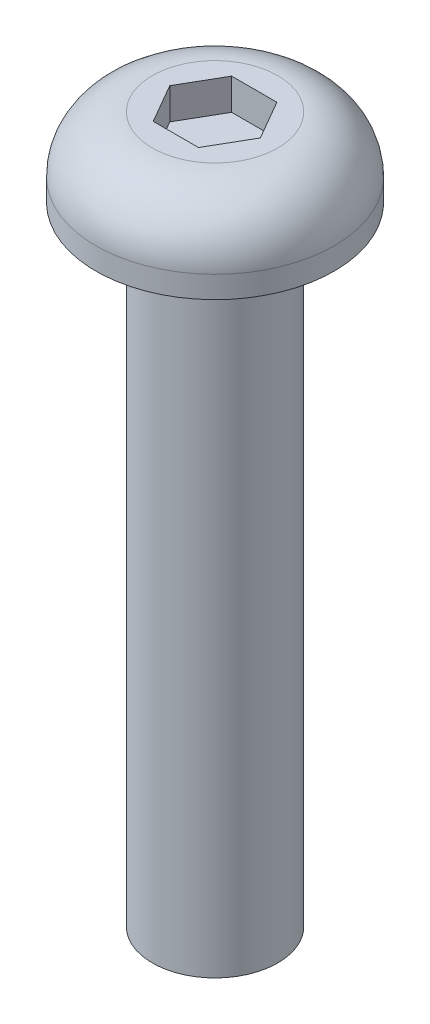
ISO-10303-21;
HEADER;
FILE_DESCRIPTION(('STEP AP214'),'2;1');
FILE_NAME('part.step','',(''),(''),'','','');
FILE_SCHEMA(('AUTOMOTIVE_DESIGN { 1 0 10303 214 1 1 1 1 }'));
ENDSEC;
DATA;
#1=APPLICATION_CONTEXT('core data for automotive mechanical design processes');
#2=APPLICATION_PROTOCOL_DEFINITION('international standard','automotive_design',2000,#1);
#3=PRODUCT_CONTEXT('',#1,'mechanical');
#4=PRODUCT('Part','Part','',(#3));
#5=PRODUCT_RELATED_PRODUCT_CATEGORY('part','',(#4));
#6=PRODUCT_DEFINITION_FORMATION('','',#4);
#7=PRODUCT_DEFINITION_CONTEXT('part definition',#1,'design');
#8=PRODUCT_DEFINITION('design','',#6,#7);
#9=PRODUCT_DEFINITION_SHAPE('','',#8);
#10=(LENGTH_UNIT() NAMED_UNIT(*) SI_UNIT(.MILLI.,.METRE.));
#11=(NAMED_UNIT(*) PLANE_ANGLE_UNIT() SI_UNIT($,.RADIAN.));
#12=(NAMED_UNIT(*) SI_UNIT($,.STERADIAN.) SOLID_ANGLE_UNIT());
#13=UNCERTAINTY_MEASURE_WITH_UNIT(LENGTH_MEASURE(1.E-05),#10,'distance_accuracy_value','');
#14=(GEOMETRIC_REPRESENTATION_CONTEXT(3) GLOBAL_UNCERTAINTY_ASSIGNED_CONTEXT((#13)) GLOBAL_UNIT_ASSIGNED_CONTEXT((#10,
#11,#12)) REPRESENTATION_CONTEXT('',''));
#15=CARTESIAN_POINT('',(0.,0.,0.));
#16=DIRECTION('',(0.,0.,1.));
#17=DIRECTION('',(1.,0.,0.));
#18=AXIS2_PLACEMENT_3D('',#15,#16,#17);
#19=CARTESIAN_POINT('',(0.,-20.,0.));
#20=DIRECTION('',(0.,-1.,0.));
#21=DIRECTION('',(0.,0.,-1.));
#22=AXIS2_PLACEMENT_3D('',#19,#20,#21);
#23=CYLINDRICAL_SURFACE('',#22,2.);
#24=CARTESIAN_POINT('',(0.,0.,0.));
#25=DIRECTION('',(0.,-1.,0.));
#26=DIRECTION('',(0.,0.,-1.));
#27=AXIS2_PLACEMENT_3D('',#24,#25,#26);
#28=CIRCLE('',#27,2.);
#29=CARTESIAN_POINT('',(0.,0.,-2.));
#30=VERTEX_POINT('',#29);
#31=EDGE_CURVE('E11',#30,#30,#28,.T.);
#32=ORIENTED_EDGE('',*,*,#31,.T.);
#33=EDGE_LOOP('',(#32));
#34=FACE_BOUND('',#33,.T.);
#35=CARTESIAN_POINT('',(0.,-20.,0.));
#36=DIRECTION('',(0.,-1.,0.));
#37=DIRECTION('',(0.,0.,-1.));
#38=AXIS2_PLACEMENT_3D('',#35,#36,#37);
#39=CIRCLE('',#38,2.);
#40=CARTESIAN_POINT('',(0.,-20.,-2.));
#41=VERTEX_POINT('',#40);
#42=EDGE_CURVE('E147',#41,#41,#39,.T.);
#43=ORIENTED_EDGE('',*,*,#42,.F.);
#44=EDGE_LOOP('',(#43));
#45=FACE_BOUND('',#44,.T.);
#46=ADVANCED_FACE('F42',(#34,#45),#23,.T.);
#47=CARTESIAN_POINT('',(2.,0.,0.));
#48=DIRECTION('',(0.,-1.,0.));
#49=DIRECTION('',(0.,0.,-1.));
#50=AXIS2_PLACEMENT_3D('',#47,#48,#49);
#51=PLANE('',#50);
#52=CARTESIAN_POINT('',(0.,0.,0.));
#53=DIRECTION('',(0.,-1.,0.));
#54=DIRECTION('',(0.,0.,-1.));
#55=AXIS2_PLACEMENT_3D('',#52,#53,#54);
#56=CIRCLE('',#55,3.8);
#57=CARTESIAN_POINT('',(0.,0.,-3.8));
#58=VERTEX_POINT('',#57);
#59=EDGE_CURVE('E50',#58,#58,#56,.T.);
#60=ORIENTED_EDGE('',*,*,#59,.T.);
#61=EDGE_LOOP('',(#60));
#62=FACE_BOUND('',#61,.T.);
#63=ORIENTED_EDGE('',*,*,#31,.F.);
#64=EDGE_LOOP('',(#63));
#65=FACE_BOUND('',#64,.T.);
#66=ADVANCED_FACE('F167',(#62,#65),#51,.T.);
#67=CARTESIAN_POINT('',(0.,-20.,0.));
#68=DIRECTION('',(0.,-1.,0.));
#69=DIRECTION('',(0.,0.,-1.));
#70=AXIS2_PLACEMENT_3D('',#67,#68,#69);
#71=CYLINDRICAL_SURFACE('',#70,3.8);
#72=CARTESIAN_POINT('',(0.,0.699999999999999,0.));
#73=DIRECTION('',(0.,-1.,0.));
#74=DIRECTION('',(0.,0.,-1.));
#75=AXIS2_PLACEMENT_3D('',#72,#73,#74);
#76=CIRCLE('',#75,3.8);
#77=CARTESIAN_POINT('',(0.,0.699999999999999,-3.8));
#78=VERTEX_POINT('',#77);
#79=EDGE_CURVE('E160',#78,#78,#76,.T.);
#80=ORIENTED_EDGE('',*,*,#79,.T.);
#81=EDGE_LOOP('',(#80));
#82=FACE_BOUND('',#81,.T.);
#83=ORIENTED_EDGE('',*,*,#59,.F.);
#84=EDGE_LOOP('',(#83));
#85=FACE_BOUND('',#84,.T.);
#86=ADVANCED_FACE('F170',(#82,#85),#71,.T.);
#87=CARTESIAN_POINT('',(0.,0.7,0.));
#88=DIRECTION('',(0.,-1.,0.));
#89=DIRECTION('',(0.,0.,-1.));
#90=AXIS2_PLACEMENT_3D('',#87,#88,#89);
#91=TOROIDAL_SURFACE('',#90,2.,1.8);
#92=CARTESIAN_POINT('',(0.,2.5,0.));
#93=DIRECTION('',(0.,-1.,0.));
#94=DIRECTION('',(0.,0.,-1.));
#95=AXIS2_PLACEMENT_3D('',#92,#93,#94);
#96=CIRCLE('',#95,2.);
#97=CARTESIAN_POINT('',(0.,2.5,-2.));
#98=VERTEX_POINT('',#97);
#99=EDGE_CURVE('E156',#98,#98,#96,.T.);
#100=ORIENTED_EDGE('',*,*,#99,.T.);
#101=EDGE_LOOP('',(#100));
#102=FACE_BOUND('',#101,.T.);
#103=ORIENTED_EDGE('',*,*,#79,.F.);
#104=EDGE_LOOP('',(#103));
#105=FACE_BOUND('',#104,.T.);
#106=ADVANCED_FACE('F172',(#102,#105),#91,.T.);
#107=CARTESIAN_POINT('',(2.,2.5,0.));
#108=DIRECTION('',(0.,1.,0.));
#109=DIRECTION('',(0.,0.,1.));
#110=AXIS2_PLACEMENT_3D('',#107,#108,#109);
#111=PLANE('',#110);
#112=DIRECTION('',(-0.5,0.,-0.866025403784438));
#113=VECTOR('',#112,1.);
#114=CARTESIAN_POINT('',(1.44337567297406,2.5,0.));
#115=LINE('',#114,#113);
#116=CARTESIAN_POINT('',(1.44337567297406,2.5,0.));
#117=VERTEX_POINT('',#116);
#118=CARTESIAN_POINT('',(0.721687836487031,2.5,-1.25));
#119=VERTEX_POINT('',#118);
#120=EDGE_CURVE('E57',#117,#119,#115,.T.);
#121=ORIENTED_EDGE('',*,*,#120,.F.);
#122=DIRECTION('',(0.5,0.,-0.866025403784439));
#123=VECTOR('',#122,1.);
#124=CARTESIAN_POINT('',(0.721687836487032,2.5,1.25));
#125=LINE('',#124,#123);
#126=CARTESIAN_POINT('',(0.721687836487032,2.5,1.25));
#127=VERTEX_POINT('',#126);
#128=EDGE_CURVE('E143',#127,#117,#125,.T.);
#129=ORIENTED_EDGE('',*,*,#128,.F.);
#130=DIRECTION('',(1.,0.,0.));
#131=VECTOR('',#130,1.);
#132=CARTESIAN_POINT('',(-0.721687836487032,2.5,1.25));
#133=LINE('',#132,#131);
#134=CARTESIAN_POINT('',(-0.721687836487032,2.5,1.25));
#135=VERTEX_POINT('',#134);
#136=EDGE_CURVE('E141',#135,#127,#133,.T.);
#137=ORIENTED_EDGE('',*,*,#136,.F.);
#138=DIRECTION('',(0.5,0.,0.866025403784438));
#139=VECTOR('',#138,1.);
#140=CARTESIAN_POINT('',(-1.44337567297406,2.5,0.));
#141=LINE('',#140,#139);
#142=CARTESIAN_POINT('',(-1.44337567297406,2.5,0.));
#143=VERTEX_POINT('',#142);
#144=EDGE_CURVE('E106',#143,#135,#141,.T.);
#145=ORIENTED_EDGE('',*,*,#144,.F.);
#146=DIRECTION('',(-0.5,0.,0.866025403784439));
#147=VECTOR('',#146,1.);
#148=CARTESIAN_POINT('',(-0.721687836487033,2.5,-1.25));
#149=LINE('',#148,#147);
#150=CARTESIAN_POINT('',(-0.721687836487033,2.5,-1.25));
#151=VERTEX_POINT('',#150);
#152=EDGE_CURVE('E136',#151,#143,#149,.T.);
#153=ORIENTED_EDGE('',*,*,#152,.F.);
#154=DIRECTION('',(-1.,0.,0.));
#155=VECTOR('',#154,1.);
#156=CARTESIAN_POINT('',(0.721687836487031,2.5,-1.25));
#157=LINE('',#156,#155);
#158=EDGE_CURVE('E133',#119,#151,#157,.T.);
#159=ORIENTED_EDGE('',*,*,#158,.F.);
#160=EDGE_LOOP('',(#121,#129,#137,#145,#153,#159));
#161=FACE_BOUND('',#160,.T.);
#162=ORIENTED_EDGE('',*,*,#99,.F.);
#163=EDGE_LOOP('',(#162));
#164=FACE_BOUND('',#163,.T.);
#165=ADVANCED_FACE('F179',(#161,#164),#111,.T.);
#166=CARTESIAN_POINT('',(2.,-20.,0.));
#167=DIRECTION('',(0.,-1.,0.));
#168=DIRECTION('',(0.,0.,-1.));
#169=AXIS2_PLACEMENT_3D('',#166,#167,#168);
#170=PLANE('',#169);
#171=ORIENTED_EDGE('',*,*,#42,.T.);
#172=EDGE_LOOP('',(#171));
#173=FACE_BOUND('',#172,.T.);
#174=ADVANCED_FACE('F190',(#173),#170,.T.);
#175=CARTESIAN_POINT('',(1.44337567297406,1.5,0.));
#176=DIRECTION('',(0.866025403784438,0.,-0.5));
#177=DIRECTION('',(-0.5,0.,-0.866025403784438));
#178=AXIS2_PLACEMENT_3D('',#175,#176,#177);
#179=PLANE('',#178);
#180=ORIENTED_EDGE('',*,*,#120,.T.);
#181=DIRECTION('',(0.,1.,0.));
#182=VECTOR('',#181,1.);
#183=CARTESIAN_POINT('',(0.721687836487031,1.5,-1.25));
#184=LINE('',#183,#182);
#185=CARTESIAN_POINT('',(0.721687836487031,1.5,-1.25));
#186=VERTEX_POINT('',#185);
#187=EDGE_CURVE('E87',#186,#119,#184,.T.);
#188=ORIENTED_EDGE('',*,*,#187,.F.);
#189=DIRECTION('',(-0.5,0.,-0.866025403784438));
#190=VECTOR('',#189,1.);
#191=CARTESIAN_POINT('',(1.44337567297406,1.5,0.));
#192=LINE('',#191,#190);
#193=CARTESIAN_POINT('',(1.44337567297406,1.5,0.));
#194=VERTEX_POINT('',#193);
#195=EDGE_CURVE('E145',#194,#186,#192,.T.);
#196=ORIENTED_EDGE('',*,*,#195,.F.);
#197=DIRECTION('',(0.,1.,0.));
#198=VECTOR('',#197,1.);
#199=CARTESIAN_POINT('',(1.44337567297406,1.5,0.));
#200=LINE('',#199,#198);
#201=EDGE_CURVE('E65',#194,#117,#200,.T.);
#202=ORIENTED_EDGE('',*,*,#201,.T.);
#203=EDGE_LOOP('',(#180,#188,#196,#202));
#204=FACE_BOUND('',#203,.T.);
#205=ADVANCED_FACE('F192',(#204),#179,.F.);
#206=CARTESIAN_POINT('',(0.721687836487032,1.5,1.25));
#207=DIRECTION('',(0.866025403784439,0.,0.5));
#208=DIRECTION('',(0.5,0.,-0.866025403784439));
#209=AXIS2_PLACEMENT_3D('',#206,#207,#208);
#210=PLANE('',#209);
#211=ORIENTED_EDGE('',*,*,#128,.T.);
#212=ORIENTED_EDGE('',*,*,#201,.F.);
#213=DIRECTION('',(0.5,0.,-0.866025403784439));
#214=VECTOR('',#213,1.);
#215=CARTESIAN_POINT('',(0.721687836487032,1.5,1.25));
#216=LINE('',#215,#214);
#217=CARTESIAN_POINT('',(0.721687836487032,1.5,1.25));
#218=VERTEX_POINT('',#217);
#219=EDGE_CURVE('E118',#218,#194,#216,.T.);
#220=ORIENTED_EDGE('',*,*,#219,.F.);
#221=DIRECTION('',(0.,1.,0.));
#222=VECTOR('',#221,1.);
#223=CARTESIAN_POINT('',(0.721687836487032,1.5,1.25));
#224=LINE('',#223,#222);
#225=EDGE_CURVE('E110',#218,#127,#224,.T.);
#226=ORIENTED_EDGE('',*,*,#225,.T.);
#227=EDGE_LOOP('',(#211,#212,#220,#226));
#228=FACE_BOUND('',#227,.T.);
#229=ADVANCED_FACE('F198',(#228),#210,.F.);
#230=CARTESIAN_POINT('',(-0.721687836487032,1.5,1.25));
#231=DIRECTION('',(0.,0.,1.));
#232=DIRECTION('',(1.,0.,0.));
#233=AXIS2_PLACEMENT_3D('',#230,#231,#232);
#234=PLANE('',#233);
#235=ORIENTED_EDGE('',*,*,#136,.T.);
#236=ORIENTED_EDGE('',*,*,#225,.F.);
#237=DIRECTION('',(1.,0.,0.));
#238=VECTOR('',#237,1.);
#239=CARTESIAN_POINT('',(-0.721687836487032,1.5,1.25));
#240=LINE('',#239,#238);
#241=CARTESIAN_POINT('',(-0.721687836487032,1.5,1.25));
#242=VERTEX_POINT('',#241);
#243=EDGE_CURVE('E114',#242,#218,#240,.T.);
#244=ORIENTED_EDGE('',*,*,#243,.F.);
#245=DIRECTION('',(0.,1.,0.));
#246=VECTOR('',#245,1.);
#247=CARTESIAN_POINT('',(-0.721687836487032,1.5,1.25));
#248=LINE('',#247,#246);
#249=EDGE_CURVE('E99',#242,#135,#248,.T.);
#250=ORIENTED_EDGE('',*,*,#249,.T.);
#251=EDGE_LOOP('',(#235,#236,#244,#250));
#252=FACE_BOUND('',#251,.T.);
#253=ADVANCED_FACE('F115',(#252),#234,.F.);
#254=CARTESIAN_POINT('',(-1.44337567297406,1.5,0.));
#255=DIRECTION('',(-0.866025403784438,0.,0.5));
#256=DIRECTION('',(0.5,0.,0.866025403784438));
#257=AXIS2_PLACEMENT_3D('',#254,#255,#256);
#258=PLANE('',#257);
#259=ORIENTED_EDGE('',*,*,#144,.T.);
#260=ORIENTED_EDGE('',*,*,#249,.F.);
#261=DIRECTION('',(0.5,0.,0.866025403784438));
#262=VECTOR('',#261,1.);
#263=CARTESIAN_POINT('',(-1.44337567297406,1.5,0.));
#264=LINE('',#263,#262);
#265=CARTESIAN_POINT('',(-1.44337567297406,1.5,0.));
#266=VERTEX_POINT('',#265);
#267=EDGE_CURVE('E103',#266,#242,#264,.T.);
#268=ORIENTED_EDGE('',*,*,#267,.F.);
#269=DIRECTION('',(0.,1.,0.));
#270=VECTOR('',#269,1.);
#271=CARTESIAN_POINT('',(-1.44337567297406,1.5,0.));
#272=LINE('',#271,#270);
#273=EDGE_CURVE('E111',#266,#143,#272,.T.);
#274=ORIENTED_EDGE('',*,*,#273,.T.);
#275=EDGE_LOOP('',(#259,#260,#268,#274));
#276=FACE_BOUND('',#275,.T.);
#277=ADVANCED_FACE('F101',(#276),#258,.F.);
#278=CARTESIAN_POINT('',(-0.721687836487033,1.5,-1.25));
#279=DIRECTION('',(-0.866025403784439,0.,-0.5));
#280=DIRECTION('',(-0.5,0.,0.866025403784439));
#281=AXIS2_PLACEMENT_3D('',#278,#279,#280);
#282=PLANE('',#281);
#283=ORIENTED_EDGE('',*,*,#152,.T.);
#284=ORIENTED_EDGE('',*,*,#273,.F.);
#285=DIRECTION('',(-0.5,0.,0.866025403784439));
#286=VECTOR('',#285,1.);
#287=CARTESIAN_POINT('',(-0.721687836487033,1.5,-1.25));
#288=LINE('',#287,#286);
#289=CARTESIAN_POINT('',(-0.721687836487033,1.5,-1.25));
#290=VERTEX_POINT('',#289);
#291=EDGE_CURVE('E124',#290,#266,#288,.T.);
#292=ORIENTED_EDGE('',*,*,#291,.F.);
#293=DIRECTION('',(0.,1.,0.));
#294=VECTOR('',#293,1.);
#295=CARTESIAN_POINT('',(-0.721687836487033,1.5,-1.25));
#296=LINE('',#295,#294);
#297=EDGE_CURVE('E150',#290,#151,#296,.T.);
#298=ORIENTED_EDGE('',*,*,#297,.T.);
#299=EDGE_LOOP('',(#283,#284,#292,#298));
#300=FACE_BOUND('',#299,.T.);
#301=ADVANCED_FACE('F206',(#300),#282,.F.);
#302=CARTESIAN_POINT('',(0.721687836487031,1.5,-1.25));
#303=DIRECTION('',(0.,0.,-1.));
#304=DIRECTION('',(-1.,0.,0.));
#305=AXIS2_PLACEMENT_3D('',#302,#303,#304);
#306=PLANE('',#305);
#307=ORIENTED_EDGE('',*,*,#158,.T.);
#308=ORIENTED_EDGE('',*,*,#297,.F.);
#309=DIRECTION('',(-1.,0.,0.));
#310=VECTOR('',#309,1.);
#311=CARTESIAN_POINT('',(0.721687836487031,1.5,-1.25));
#312=LINE('',#311,#310);
#313=EDGE_CURVE('E127',#186,#290,#312,.T.);
#314=ORIENTED_EDGE('',*,*,#313,.F.);
#315=ORIENTED_EDGE('',*,*,#187,.T.);
#316=EDGE_LOOP('',(#307,#308,#314,#315));
#317=FACE_BOUND('',#316,.T.);
#318=ADVANCED_FACE('F203',(#317),#306,.F.);
#319=CARTESIAN_POINT('',(0.,1.5,0.));
#320=DIRECTION('',(0.,1.,0.));
#321=DIRECTION('',(0.,0.,1.));
#322=AXIS2_PLACEMENT_3D('',#319,#320,#321);
#323=PLANE('',#322);
#324=ORIENTED_EDGE('',*,*,#195,.T.);
#325=ORIENTED_EDGE('',*,*,#313,.T.);
#326=ORIENTED_EDGE('',*,*,#291,.T.);
#327=ORIENTED_EDGE('',*,*,#267,.T.);
#328=ORIENTED_EDGE('',*,*,#243,.T.);
#329=ORIENTED_EDGE('',*,*,#219,.T.);
#330=EDGE_LOOP('',(#324,#325,#326,#327,#328,#329));
#331=FACE_BOUND('',#330,.T.);
#332=ADVANCED_FACE('F121',(#331),#323,.T.);
#333=CLOSED_SHELL('',(#46,#66,#86,#106,#165,#174,#205,#229,#253,#277,#301,#318,#332));
#334=MANIFOLD_SOLID_BREP('B2',#333);
#335=ADVANCED_BREP_SHAPE_REPRESENTATION('',(#18,#334),#14);
#336=SHAPE_DEFINITION_REPRESENTATION(#9,#335);
ENDSEC;
END-ISO-10303-21;
